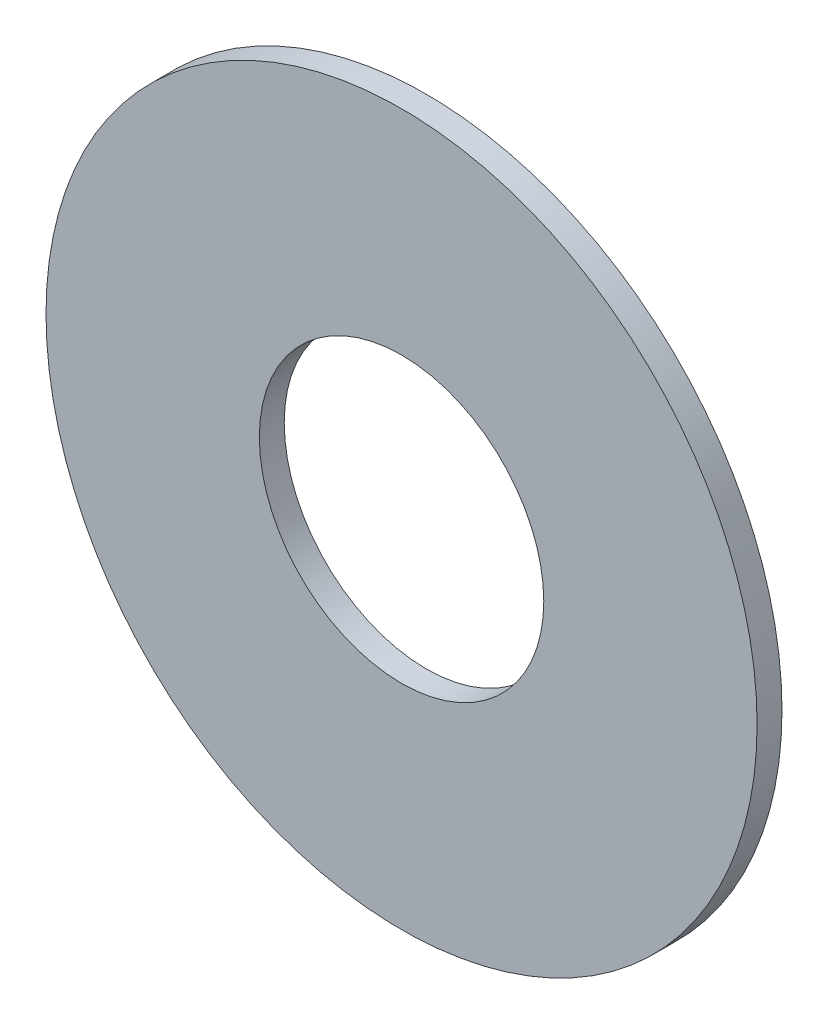
ISO-10303-21;
HEADER;
FILE_DESCRIPTION(('STEP AP214'),'2;1');
FILE_NAME('part.step','',(''),(''),'','','');
FILE_SCHEMA(('AUTOMOTIVE_DESIGN { 1 0 10303 214 1 1 1 1 }'));
ENDSEC;
DATA;
#1=APPLICATION_CONTEXT('core data for automotive mechanical design processes');
#2=APPLICATION_PROTOCOL_DEFINITION('international standard','automotive_design',2000,#1);
#3=PRODUCT_CONTEXT('',#1,'mechanical');
#4=PRODUCT('Part','Part','',(#3));
#5=PRODUCT_RELATED_PRODUCT_CATEGORY('part','',(#4));
#6=PRODUCT_DEFINITION_FORMATION('','',#4);
#7=PRODUCT_DEFINITION_CONTEXT('part definition',#1,'design');
#8=PRODUCT_DEFINITION('design','',#6,#7);
#9=PRODUCT_DEFINITION_SHAPE('','',#8);
#10=(LENGTH_UNIT() NAMED_UNIT(*) SI_UNIT(.MILLI.,.METRE.));
#11=(NAMED_UNIT(*) PLANE_ANGLE_UNIT() SI_UNIT($,.RADIAN.));
#12=(NAMED_UNIT(*) SI_UNIT($,.STERADIAN.) SOLID_ANGLE_UNIT());
#13=UNCERTAINTY_MEASURE_WITH_UNIT(LENGTH_MEASURE(1.E-05),#10,'distance_accuracy_value','');
#14=(GEOMETRIC_REPRESENTATION_CONTEXT(3) GLOBAL_UNCERTAINTY_ASSIGNED_CONTEXT((#13)) GLOBAL_UNIT_ASSIGNED_CONTEXT((#10,
#11,#12)) REPRESENTATION_CONTEXT('',''));
#15=CARTESIAN_POINT('',(0.,0.,0.));
#16=DIRECTION('',(0.,0.,1.));
#17=DIRECTION('',(1.,0.,0.));
#18=AXIS2_PLACEMENT_3D('',#15,#16,#17);
#19=CARTESIAN_POINT('',(0.,0.,0.7));
#20=DIRECTION('',(0.,0.,-1.));
#21=DIRECTION('',(-1.,0.,0.));
#22=AXIS2_PLACEMENT_3D('',#19,#20,#21);
#23=CYLINDRICAL_SURFACE('',#22,10.);
#24=CARTESIAN_POINT('',(0.,0.,0.7));
#25=DIRECTION('',(0.,0.,1.));
#26=DIRECTION('',(1.,0.,0.));
#27=AXIS2_PLACEMENT_3D('',#24,#25,#26);
#28=CIRCLE('',#27,10.);
#29=CARTESIAN_POINT('',(10.,0.,0.7));
#30=VERTEX_POINT('',#29);
#31=EDGE_CURVE('E10',#30,#30,#28,.T.);
#32=ORIENTED_EDGE('',*,*,#31,.F.);
#33=EDGE_LOOP('',(#32));
#34=FACE_BOUND('',#33,.T.);
#35=CARTESIAN_POINT('',(0.,0.,0.));
#36=DIRECTION('',(0.,0.,1.));
#37=DIRECTION('',(1.,0.,0.));
#38=AXIS2_PLACEMENT_3D('',#35,#36,#37);
#39=CIRCLE('',#38,10.);
#40=CARTESIAN_POINT('',(10.,0.,0.));
#41=VERTEX_POINT('',#40);
#42=EDGE_CURVE('E52',#41,#41,#39,.T.);
#43=ORIENTED_EDGE('',*,*,#42,.T.);
#44=EDGE_LOOP('',(#43));
#45=FACE_BOUND('',#44,.T.);
#46=ADVANCED_FACE('F45',(#34,#45),#23,.T.);
#47=CARTESIAN_POINT('',(0.,0.,0.7));
#48=DIRECTION('',(0.,0.,1.));
#49=DIRECTION('',(1.,0.,0.));
#50=AXIS2_PLACEMENT_3D('',#47,#48,#49);
#51=PLANE('',#50);
#52=CARTESIAN_POINT('',(0.,0.,0.7));
#53=DIRECTION('',(0.,0.,1.));
#54=DIRECTION('',(1.,0.,0.));
#55=AXIS2_PLACEMENT_3D('',#52,#53,#54);
#56=CIRCLE('',#55,4.);
#57=CARTESIAN_POINT('',(4.,0.,0.7));
#58=VERTEX_POINT('',#57);
#59=EDGE_CURVE('E58',#58,#58,#56,.T.);
#60=ORIENTED_EDGE('',*,*,#59,.F.);
#61=EDGE_LOOP('',(#60));
#62=FACE_BOUND('',#61,.T.);
#63=ORIENTED_EDGE('',*,*,#31,.T.);
#64=EDGE_LOOP('',(#63));
#65=FACE_BOUND('',#64,.T.);
#66=ADVANCED_FACE('F74',(#62,#65),#51,.T.);
#67=CARTESIAN_POINT('',(0.,0.,0.));
#68=DIRECTION('',(0.,0.,1.));
#69=DIRECTION('',(1.,0.,0.));
#70=AXIS2_PLACEMENT_3D('',#67,#68,#69);
#71=PLANE('',#70);
#72=CARTESIAN_POINT('',(0.,0.,0.));
#73=DIRECTION('',(0.,0.,1.));
#74=DIRECTION('',(1.,0.,0.));
#75=AXIS2_PLACEMENT_3D('',#72,#73,#74);
#76=CIRCLE('',#75,4.);
#77=CARTESIAN_POINT('',(4.,0.,0.));
#78=VERTEX_POINT('',#77);
#79=EDGE_CURVE('E48',#78,#78,#76,.T.);
#80=ORIENTED_EDGE('',*,*,#79,.T.);
#81=EDGE_LOOP('',(#80));
#82=FACE_BOUND('',#81,.T.);
#83=ORIENTED_EDGE('',*,*,#42,.F.);
#84=EDGE_LOOP('',(#83));
#85=FACE_BOUND('',#84,.T.);
#86=ADVANCED_FACE('F65',(#82,#85),#71,.F.);
#87=CARTESIAN_POINT('',(0.,0.,-0.8));
#88=DIRECTION('',(0.,0.,1.));
#89=DIRECTION('',(1.,0.,0.));
#90=AXIS2_PLACEMENT_3D('',#87,#88,#89);
#91=CYLINDRICAL_SURFACE('',#90,4.);
#92=ORIENTED_EDGE('',*,*,#59,.T.);
#93=EDGE_LOOP('',(#92));
#94=FACE_BOUND('',#93,.T.);
#95=ORIENTED_EDGE('',*,*,#79,.F.);
#96=EDGE_LOOP('',(#95));
#97=FACE_BOUND('',#96,.T.);
#98=ADVANCED_FACE('F68',(#94,#97),#91,.F.);
#99=CLOSED_SHELL('',(#46,#66,#86,#98));
#100=MANIFOLD_SOLID_BREP('B2',#99);
#101=ADVANCED_BREP_SHAPE_REPRESENTATION('',(#18,#100),#14);
#102=SHAPE_DEFINITION_REPRESENTATION(#9,#101);
ENDSEC;
END-ISO-10303-21;
